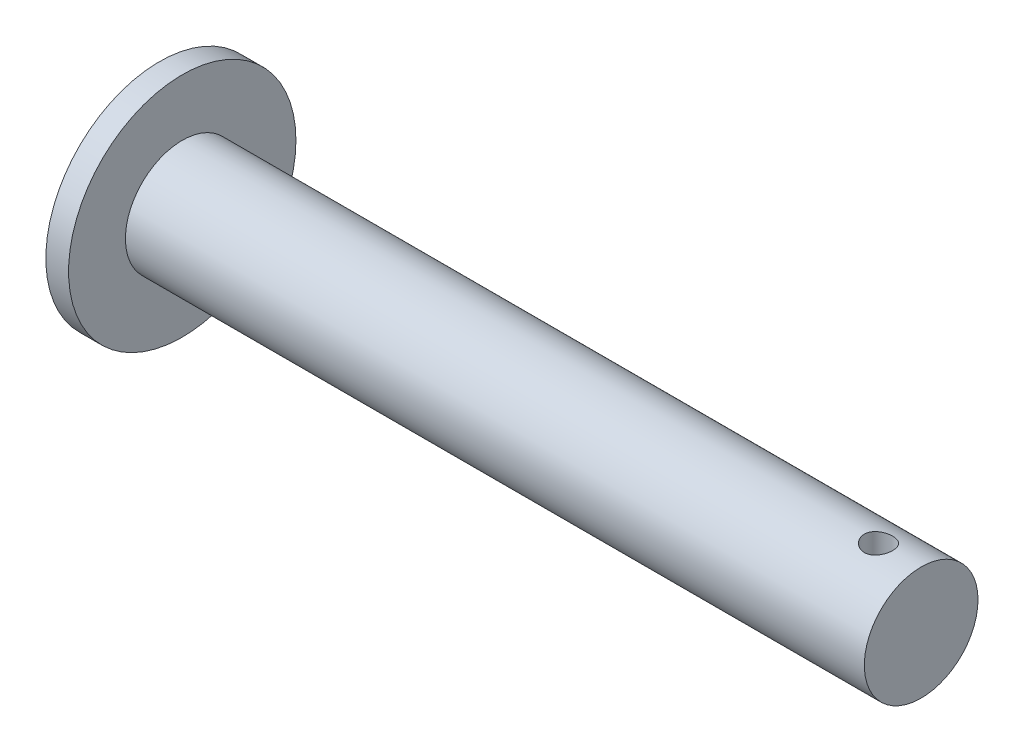
ISO-10303-21;
HEADER;
FILE_DESCRIPTION(('STEP AP214'),'2;1');
FILE_NAME('part.step','',(''),(''),'','','');
FILE_SCHEMA(('AUTOMOTIVE_DESIGN { 1 0 10303 214 1 1 1 1 }'));
ENDSEC;
DATA;
#1=APPLICATION_CONTEXT('core data for automotive mechanical design processes');
#2=APPLICATION_PROTOCOL_DEFINITION('international standard','automotive_design',2000,#1);
#3=PRODUCT_CONTEXT('',#1,'mechanical');
#4=PRODUCT('Part','Part','',(#3));
#5=PRODUCT_RELATED_PRODUCT_CATEGORY('part','',(#4));
#6=PRODUCT_DEFINITION_FORMATION('','',#4);
#7=PRODUCT_DEFINITION_CONTEXT('part definition',#1,'design');
#8=PRODUCT_DEFINITION('design','',#6,#7);
#9=PRODUCT_DEFINITION_SHAPE('','',#8);
#10=(LENGTH_UNIT() NAMED_UNIT(*) SI_UNIT(.MILLI.,.METRE.));
#11=(NAMED_UNIT(*) PLANE_ANGLE_UNIT() SI_UNIT($,.RADIAN.));
#12=(NAMED_UNIT(*) SI_UNIT($,.STERADIAN.) SOLID_ANGLE_UNIT());
#13=UNCERTAINTY_MEASURE_WITH_UNIT(LENGTH_MEASURE(1.E-05),#10,'distance_accuracy_value','');
#14=(GEOMETRIC_REPRESENTATION_CONTEXT(3) GLOBAL_UNCERTAINTY_ASSIGNED_CONTEXT((#13)) GLOBAL_UNIT_ASSIGNED_CONTEXT((#10,
#11,#12)) REPRESENTATION_CONTEXT('',''));
#15=CARTESIAN_POINT('',(0.,0.,0.));
#16=DIRECTION('',(0.,0.,1.));
#17=DIRECTION('',(1.,0.,0.));
#18=AXIS2_PLACEMENT_3D('',#15,#16,#17);
#19=CARTESIAN_POINT('',(2.54,0.,0.));
#20=DIRECTION('',(-1.,0.,0.));
#21=DIRECTION('',(0.,0.,1.));
#22=AXIS2_PLACEMENT_3D('',#19,#20,#21);
#23=CYLINDRICAL_SURFACE('',#22,12.7);
#24=CARTESIAN_POINT('',(2.54,0.,0.));
#25=DIRECTION('',(1.,0.,0.));
#26=DIRECTION('',(0.,0.,-1.));
#27=AXIS2_PLACEMENT_3D('',#24,#25,#26);
#28=CIRCLE('',#27,12.7);
#29=CARTESIAN_POINT('',(2.54,0.,-12.7));
#30=VERTEX_POINT('',#29);
#31=EDGE_CURVE('E43',#30,#30,#28,.T.);
#32=ORIENTED_EDGE('',*,*,#31,.F.);
#33=EDGE_LOOP('',(#32));
#34=FACE_BOUND('',#33,.T.);
#35=CARTESIAN_POINT('',(0.,0.,0.));
#36=DIRECTION('',(1.,0.,0.));
#37=DIRECTION('',(0.,0.,-1.));
#38=AXIS2_PLACEMENT_3D('',#35,#36,#37);
#39=CIRCLE('',#38,12.7);
#40=CARTESIAN_POINT('',(0.,0.,-12.7));
#41=VERTEX_POINT('',#40);
#42=EDGE_CURVE('E48',#41,#41,#39,.T.);
#43=ORIENTED_EDGE('',*,*,#42,.T.);
#44=EDGE_LOOP('',(#43));
#45=FACE_BOUND('',#44,.T.);
#46=ADVANCED_FACE('F31',(#34,#45),#23,.T.);
#47=CARTESIAN_POINT('',(2.54,0.,0.));
#48=DIRECTION('',(1.,0.,0.));
#49=DIRECTION('',(0.,0.,-1.));
#50=AXIS2_PLACEMENT_3D('',#47,#48,#49);
#51=PLANE('',#50);
#52=CARTESIAN_POINT('',(2.54,0.,0.));
#53=DIRECTION('',(1.,0.,0.));
#54=DIRECTION('',(0.,0.,-1.));
#55=AXIS2_PLACEMENT_3D('',#52,#53,#54);
#56=CIRCLE('',#55,6.35);
#57=CARTESIAN_POINT('',(2.54,0.,-6.35));
#58=VERTEX_POINT('',#57);
#59=EDGE_CURVE('E10',#58,#58,#56,.T.);
#60=ORIENTED_EDGE('',*,*,#59,.F.);
#61=EDGE_LOOP('',(#60));
#62=FACE_BOUND('',#61,.T.);
#63=ORIENTED_EDGE('',*,*,#31,.T.);
#64=EDGE_LOOP('',(#63));
#65=FACE_BOUND('',#64,.T.);
#66=ADVANCED_FACE('F78',(#62,#65),#51,.T.);
#67=CARTESIAN_POINT('',(0.,0.,0.));
#68=DIRECTION('',(1.,0.,0.));
#69=DIRECTION('',(0.,0.,-1.));
#70=AXIS2_PLACEMENT_3D('',#67,#68,#69);
#71=PLANE('',#70);
#72=ORIENTED_EDGE('',*,*,#42,.F.);
#73=EDGE_LOOP('',(#72));
#74=FACE_BOUND('',#73,.T.);
#75=ADVANCED_FACE('F74',(#74),#71,.F.);
#76=CARTESIAN_POINT('',(85.09,0.,0.));
#77=DIRECTION('',(-1.,0.,0.));
#78=DIRECTION('',(0.,0.,1.));
#79=AXIS2_PLACEMENT_3D('',#76,#77,#78);
#80=CYLINDRICAL_SURFACE('',#79,6.35);
#81=CARTESIAN_POINT('',(80.3275,-6.14836106210428,1.5875));
#82=CARTESIAN_POINT('',(80.4151622268371,-6.14836273554171,1.58749750990578));
#83=CARTESIAN_POINT('',(80.5028520106605,-6.15025634318835,1.58021416589079));
#84=CARTESIAN_POINT('',(80.6757134121405,-6.15760682365713,1.55131968466973));
#85=CARTESIAN_POINT('',(80.7608835340874,-6.16306577024852,1.52970020878129));
#86=CARTESIAN_POINT('',(80.9261802467488,-6.17689090118439,1.47287691176628));
#87=CARTESIAN_POINT('',(81.0063131936699,-6.1852533310841,1.43769062718758));
#88=CARTESIAN_POINT('',(81.1595473913629,-6.20393851938293,1.35478592470099));
#89=CARTESIAN_POINT('',(81.2326483434209,-6.21426136100349,1.30706697473603));
#90=CARTESIAN_POINT('',(81.3713521447415,-6.23595854885813,1.19932985134303));
#91=CARTESIAN_POINT('',(81.4367774362223,-6.24734969490624,1.13908642369207));
#92=CARTESIAN_POINT('',(81.5567084854188,-6.26975425952214,1.00849561070392));
#93=CARTESIAN_POINT('',(81.6112132222698,-6.28076764269657,0.938147281804498));
#94=CARTESIAN_POINT('',(81.7084824219458,-6.30136163855569,0.78812720268514));
#95=CARTESIAN_POINT('',(81.7510724564825,-6.31092011499376,0.708339055883903));
#96=CARTESIAN_POINT('',(81.8221691240372,-6.32733565573,0.542457122025901));
#97=CARTESIAN_POINT('',(81.8506778349663,-6.33419311857309,0.456364267477876));
#98=CARTESIAN_POINT('',(81.8922338749574,-6.34431521868594,0.282167811808885));
#99=CARTESIAN_POINT('',(81.9055827241474,-6.34764982591139,0.194140276913593));
#100=CARTESIAN_POINT('',(81.91738657084,-6.35059432258134,0.0170363002318534));
#101=CARTESIAN_POINT('',(81.9158437703531,-6.35020476271407,-0.0720399845316785));
#102=CARTESIAN_POINT('',(81.8981249700911,-6.34579690295494,-0.24662169238617));
#103=CARTESIAN_POINT('',(81.8822744335908,-6.34185931486455,-0.332162492266699));
#104=CARTESIAN_POINT('',(81.8369132435192,-6.33089181193282,-0.499329467769232));
#105=CARTESIAN_POINT('',(81.8074018627853,-6.3238617324801,-0.580955434750574));
#106=CARTESIAN_POINT('',(81.7352933676137,-6.30737568660069,-0.738833141809122));
#107=CARTESIAN_POINT('',(81.6925804266398,-6.29789837506359,-0.81502965925433));
#108=CARTESIAN_POINT('',(81.5953691437612,-6.27754588919127,-0.959287550465532));
#109=CARTESIAN_POINT('',(81.540868751464,-6.26667047179331,-1.02734750569825));
#110=CARTESIAN_POINT('',(81.4198849488412,-6.24435958243645,-1.15534128069737));
#111=CARTESIAN_POINT('',(81.3531171433591,-6.23291691898958,-1.21500531553188));
#112=CARTESIAN_POINT('',(81.2104040168019,-6.21103052633108,-1.3223499968413));
#113=CARTESIAN_POINT('',(81.1344582670232,-6.20058684382291,-1.37003008322306));
#114=CARTESIAN_POINT('',(80.9750158283154,-6.18185515488096,-1.45222615482338));
#115=CARTESIAN_POINT('',(80.8914843112511,-6.17357784665832,-1.48667718756566));
#116=CARTESIAN_POINT('',(80.7195582277714,-6.16025336488873,-1.54096342276019));
#117=CARTESIAN_POINT('',(80.6311647063707,-6.15520550014489,-1.56080175290275));
#118=CARTESIAN_POINT('',(80.4545257165328,-6.14905651084854,-1.58485182055239));
#119=CARTESIAN_POINT('',(80.3663380012357,-6.14785466574466,-1.58946245093896));
#120=CARTESIAN_POINT('',(80.1904530702729,-6.1492596311046,-1.58401828897737));
#121=CARTESIAN_POINT('',(80.1027558102009,-6.15186609096804,-1.57396484663399));
#122=CARTESIAN_POINT('',(79.9318224417538,-6.16049747041146,-1.53982766960041));
#123=CARTESIAN_POINT('',(79.8485368186275,-6.16646576098828,-1.51597618335891));
#124=CARTESIAN_POINT('',(79.6871460242642,-6.18109456102061,-1.45517748186084));
#125=CARTESIAN_POINT('',(79.6090414679999,-6.18975538937869,-1.41822871529746));
#126=CARTESIAN_POINT('',(79.4585397885542,-6.20900547054222,-1.33144937413971));
#127=CARTESIAN_POINT('',(79.3862846865726,-6.21962922065218,-1.28138031368562));
#128=CARTESIAN_POINT('',(79.2510553896211,-6.2415234775054,-1.17008321503344));
#129=CARTESIAN_POINT('',(79.1880827229272,-6.25279409032579,-1.10885334300363));
#130=CARTESIAN_POINT('',(79.0715899879674,-6.2750535092507,-0.975142069563244));
#131=CARTESIAN_POINT('',(79.0183458602815,-6.28602820809266,-0.902417474643896));
#132=CARTESIAN_POINT('',(78.924825724486,-6.30616732549721,-0.748828008777791));
#133=CARTESIAN_POINT('',(78.8845490399538,-6.31533183847515,-0.66796356272017));
#134=CARTESIAN_POINT('',(78.8184567680748,-6.33076023493829,-0.500948645248101));
#135=CARTESIAN_POINT('',(78.7925371794193,-6.3370449206423,-0.414841342381758));
#136=CARTESIAN_POINT('',(78.7555826875236,-6.34609661306326,-0.239315244506103));
#137=CARTESIAN_POINT('',(78.7445449117007,-6.34886429864815,-0.149897092002969));
#138=CARTESIAN_POINT('',(78.7378289515488,-6.35054243936488,0.0271200982287863));
#139=CARTESIAN_POINT('',(78.7417435368111,-6.34955516472013,0.114702950308583));
#140=CARTESIAN_POINT('',(78.7638884258297,-6.3440611062616,0.287920900558404));
#141=CARTESIAN_POINT('',(78.7821183038333,-6.33955442711888,0.373556056577162));
#142=CARTESIAN_POINT('',(78.8321578988863,-6.32754374655666,0.54002151908615));
#143=CARTESIAN_POINT('',(78.863893982137,-6.32005601147982,0.620875210147371));
#144=CARTESIAN_POINT('',(78.9399782941932,-6.30287171149997,0.776155821703334));
#145=CARTESIAN_POINT('',(78.9843281128629,-6.29317486818656,0.850581930508272));
#146=CARTESIAN_POINT('',(79.0856229339704,-6.27232758869116,0.992825561372944));
#147=CARTESIAN_POINT('',(79.1428442268655,-6.26114789401158,1.06044204392718));
#148=CARTESIAN_POINT('',(79.2677212775084,-6.23872655372021,1.18525134468062));
#149=CARTESIAN_POINT('',(79.3353796768054,-6.22748489312182,1.24244151604576));
#150=CARTESIAN_POINT('',(79.4807297450446,-6.2059736792862,1.34582221703578));
#151=CARTESIAN_POINT('',(79.5585850459176,-6.19572617421192,1.3917876333714));
#152=CARTESIAN_POINT('',(79.7211630902523,-6.17766029436602,1.46990894837737));
#153=CARTESIAN_POINT('',(79.8058807836944,-6.16984015341641,1.50207489424355));
#154=CARTESIAN_POINT('',(79.9632910062749,-6.15873655124406,1.54689576409763));
#155=CARTESIAN_POINT('',(80.0352303984594,-6.15487502513368,1.56208915832016));
#156=CARTESIAN_POINT('',(80.1806068295374,-6.14968668754596,1.58239188946006));
#157=CARTESIAN_POINT('',(80.254043740139,-6.14835965985316,1.58750208656584));
#158=CARTESIAN_POINT('',(80.3275,-6.14836106210428,1.5875));
#159=B_SPLINE_CURVE_WITH_KNOTS('',3,(#81,#82,#83,#84,#85,#86,#87,#88,#89,#90,#91,#92,#93,#94,
#95,#96,#97,#98,#99,#100,#101,#102,#103,#104,#105,#106,#107,#108,#109,#110,#111,#112,#113,#114,
#115,#116,#117,#118,#119,#120,#121,#122,#123,#124,#125,#126,#127,#128,#129,#130,#131,#132,#133,
#134,#135,#136,#137,#138,#139,#140,#141,#142,#143,#144,#145,#146,#147,#148,#149,#150,#151,#152,
#153,#154,#155,#156,#157,#158),.UNSPECIFIED.,.T.,.F.,(4,2,2,2,2,2,2,2,2,2,2,2,2,2,2,2,2,2,2,2,2,
2,2,2,2,2,2,2,2,2,2,2,2,2,2,2,2,2,4),(0.,0.262716925502453,0.525586795807206,0.788118011750435,
1.0506603748973,1.31841210912539,1.58618886139715,1.85770200212679,2.12917506502904,
2.39514856882045,2.66108274402923,2.92111596807482,3.1811630352024,3.44355975151572,
3.70600214772761,3.97554746273165,4.24510537311875,4.51597034325336,4.78677732082263,
5.05043169973692,5.31406180761715,5.57337852180846,5.832725961026,6.09716107120565,
6.36163966992004,6.63273585162978,6.90381788981916,7.172909662324,7.4419494855724,
7.70371488290935,7.96547249534383,8.22582096615416,8.48620226643676,8.75282156329615,
9.01950845044099,9.29117063075771,9.56263468067803,9.78279620257604,10.002938941882),.UNSPECIFIED.);
#160=CARTESIAN_POINT('',(80.3275,-6.14836106210428,1.5875));
#161=VERTEX_POINT('',#160);
#162=EDGE_CURVE('E34',#161,#161,#159,.T.);
#163=ORIENTED_EDGE('',*,*,#162,.T.);
#164=EDGE_LOOP('',(#163));
#165=FACE_BOUND('',#164,.T.);
#166=CARTESIAN_POINT('',(80.3275,6.14836106210428,1.5875));
#167=CARTESIAN_POINT('',(80.2398377731629,6.14836273554171,1.58749750990578));
#168=CARTESIAN_POINT('',(80.1521479893395,6.15025634318835,1.58021416589079));
#169=CARTESIAN_POINT('',(79.9792865878595,6.15760682365713,1.55131968466973));
#170=CARTESIAN_POINT('',(79.8941164659126,6.16306577024852,1.52970020878129));
#171=CARTESIAN_POINT('',(79.7288197532512,6.17689090118439,1.47287691176628));
#172=CARTESIAN_POINT('',(79.6486868063301,6.1852533310841,1.43769062718758));
#173=CARTESIAN_POINT('',(79.4954526086371,6.20393851938293,1.35478592470099));
#174=CARTESIAN_POINT('',(79.422351656579,6.21426136100349,1.30706697473603));
#175=CARTESIAN_POINT('',(79.2836478552585,6.23595854885813,1.19932985134303));
#176=CARTESIAN_POINT('',(79.2182225637777,6.24734969490624,1.13908642369207));
#177=CARTESIAN_POINT('',(79.0982915145812,6.26975425952214,1.00849561070392));
#178=CARTESIAN_POINT('',(79.0437867777302,6.28076764269657,0.938147281804498));
#179=CARTESIAN_POINT('',(78.9465175780541,6.30136163855569,0.78812720268514));
#180=CARTESIAN_POINT('',(78.9039275435175,6.31092011499376,0.708339055883903));
#181=CARTESIAN_POINT('',(78.8328308759628,6.32733565573,0.542457122025901));
#182=CARTESIAN_POINT('',(78.8043221650337,6.33419311857309,0.456364267477876));
#183=CARTESIAN_POINT('',(78.7627661250426,6.34431521868594,0.282167811808885));
#184=CARTESIAN_POINT('',(78.7494172758526,6.34764982591139,0.194140276913593));
#185=CARTESIAN_POINT('',(78.73761342916,6.35059432258134,0.0170363002318534));
#186=CARTESIAN_POINT('',(78.7391562296469,6.35020476271407,-0.0720399845316785));
#187=CARTESIAN_POINT('',(78.7568750299088,6.34579690295494,-0.24662169238617));
#188=CARTESIAN_POINT('',(78.7727255664092,6.34185931486455,-0.332162492266699));
#189=CARTESIAN_POINT('',(78.8180867564808,6.33089181193282,-0.499329467769232));
#190=CARTESIAN_POINT('',(78.8475981372147,6.3238617324801,-0.580955434750574));
#191=CARTESIAN_POINT('',(78.9197066323863,6.30737568660069,-0.738833141809122));
#192=CARTESIAN_POINT('',(78.9624195733602,6.29789837506359,-0.815029659254331));
#193=CARTESIAN_POINT('',(79.0596308562388,6.27754588919127,-0.959287550465531));
#194=CARTESIAN_POINT('',(79.114131248536,6.26667047179331,-1.02734750569825));
#195=CARTESIAN_POINT('',(79.2351150511588,6.24435958243645,-1.15534128069737));
#196=CARTESIAN_POINT('',(79.3018828566408,6.23291691898958,-1.21500531553188));
#197=CARTESIAN_POINT('',(79.4445959831981,6.21103052633108,-1.32234999684129));
#198=CARTESIAN_POINT('',(79.5205417329768,6.20058684382291,-1.37003008322305));
#199=CARTESIAN_POINT('',(79.6799841716846,6.18185515488096,-1.45222615482338));
#200=CARTESIAN_POINT('',(79.7635156887489,6.17357784665832,-1.48667718756566));
#201=CARTESIAN_POINT('',(79.9354417722286,6.16025336488873,-1.54096342276019));
#202=CARTESIAN_POINT('',(80.0238352936293,6.15520550014489,-1.56080175290275));
#203=CARTESIAN_POINT('',(80.2004742834672,6.14905651084854,-1.58485182055239));
#204=CARTESIAN_POINT('',(80.2886619987643,6.14785466574466,-1.58946245093896));
#205=CARTESIAN_POINT('',(80.4645469297271,6.1492596311046,-1.58401828897737));
#206=CARTESIAN_POINT('',(80.552244189799,6.15186609096804,-1.57396484663399));
#207=CARTESIAN_POINT('',(80.7231775582462,6.16049747041146,-1.53982766960041));
#208=CARTESIAN_POINT('',(80.8064631813725,6.16646576098828,-1.51597618335891));
#209=CARTESIAN_POINT('',(80.9678539757358,6.18109456102061,-1.45517748186084));
#210=CARTESIAN_POINT('',(81.0459585320001,6.1897553893787,-1.41822871529746));
#211=CARTESIAN_POINT('',(81.1964602114458,6.20900547054222,-1.33144937413971));
#212=CARTESIAN_POINT('',(81.2687153134274,6.21962922065218,-1.28138031368562));
#213=CARTESIAN_POINT('',(81.4039446103789,6.2415234775054,-1.17008321503344));
#214=CARTESIAN_POINT('',(81.4669172770728,6.25279409032579,-1.10885334300363));
#215=CARTESIAN_POINT('',(81.5834100120326,6.2750535092507,-0.975142069563244));
#216=CARTESIAN_POINT('',(81.6366541397185,6.28602820809266,-0.902417474643896));
#217=CARTESIAN_POINT('',(81.730174275514,6.30616732549721,-0.748828008777791));
#218=CARTESIAN_POINT('',(81.7704509600462,6.31533183847515,-0.66796356272017));
#219=CARTESIAN_POINT('',(81.8365432319252,6.33076023493829,-0.500948645248101));
#220=CARTESIAN_POINT('',(81.8624628205807,6.3370449206423,-0.414841342381758));
#221=CARTESIAN_POINT('',(81.8994173124764,6.34609661306326,-0.239315244506103));
#222=CARTESIAN_POINT('',(81.9104550882993,6.34886429864815,-0.149897092002969));
#223=CARTESIAN_POINT('',(81.9171710484512,6.35054243936488,0.0271200982287863));
#224=CARTESIAN_POINT('',(81.9132564631889,6.34955516472013,0.114702950308583));
#225=CARTESIAN_POINT('',(81.8911115741702,6.3440611062616,0.287920900558404));
#226=CARTESIAN_POINT('',(81.8728816961667,6.33955442711888,0.373556056577162));
#227=CARTESIAN_POINT('',(81.8228421011137,6.32754374655666,0.54002151908615));
#228=CARTESIAN_POINT('',(81.791106017863,6.32005601147982,0.620875210147371));
#229=CARTESIAN_POINT('',(81.7150217058068,6.30287171149997,0.776155821703334));
#230=CARTESIAN_POINT('',(81.6706718871371,6.29317486818656,0.850581930508273));
#231=CARTESIAN_POINT('',(81.5693770660296,6.27232758869116,0.992825561372947));
#232=CARTESIAN_POINT('',(81.5121557731345,6.26114789401158,1.06044204392719));
#233=CARTESIAN_POINT('',(81.3872787224916,6.23872655372021,1.18525134468063));
#234=CARTESIAN_POINT('',(81.3196203231946,6.22748489312182,1.24244151604576));
#235=CARTESIAN_POINT('',(81.1742702549554,6.2059736792862,1.34582221703578));
#236=CARTESIAN_POINT('',(81.0964149540824,6.19572617421192,1.3917876333714));
#237=CARTESIAN_POINT('',(80.9338369097477,6.17766029436602,1.46990894837737));
#238=CARTESIAN_POINT('',(80.8491192163055,6.16984015341641,1.50207489424355));
#239=CARTESIAN_POINT('',(80.6917089937251,6.15873655124406,1.54689576409763));
#240=CARTESIAN_POINT('',(80.6197696015406,6.15487502513368,1.56208915832016));
#241=CARTESIAN_POINT('',(80.4743931704625,6.14968668754596,1.58239188946006));
#242=CARTESIAN_POINT('',(80.400956259861,6.14835965985316,1.58750208656584));
#243=CARTESIAN_POINT('',(80.3275,6.14836106210428,1.5875));
#244=B_SPLINE_CURVE_WITH_KNOTS('',3,(#166,#167,#168,#169,#170,#171,#172,#173,#174,#175,#176,
#177,#178,#179,#180,#181,#182,#183,#184,#185,#186,#187,#188,#189,#190,#191,#192,#193,#194,#195,
#196,#197,#198,#199,#200,#201,#202,#203,#204,#205,#206,#207,#208,#209,#210,#211,#212,#213,#214,
#215,#216,#217,#218,#219,#220,#221,#222,#223,#224,#225,#226,#227,#228,#229,#230,#231,#232,#233,
#234,#235,#236,#237,#238,#239,#240,#241,#242,#243),.UNSPECIFIED.,.T.,.F.,(4,2,2,2,2,2,2,2,2,2,2,
2,2,2,2,2,2,2,2,2,2,2,2,2,2,2,2,2,2,2,2,2,2,2,2,2,2,2,4),(0.,0.262716925502453,
0.525586795807206,0.788118011750435,1.0506603748973,1.31841210912539,1.58618886139715,
1.85770200212679,2.12917506502904,2.39514856882045,2.66108274402923,2.92111596807482,
3.1811630352024,3.44355975151572,3.70600214772761,3.97554746273163,4.24510537311876,
4.51597034325337,4.78677732082263,5.05043169973692,5.31406180761715,5.57337852180847,
5.832725961026,6.09716107120566,6.36163966992005,6.63273585162978,6.90381788981917,
7.172909662324,7.4419494855724,7.70371488290935,7.96547249534383,8.22582096615416,
8.48620226643676,8.75282156329617,9.01950845044099,9.29117063075771,9.56263468067803,
9.78279620257604,10.002938941882),.UNSPECIFIED.);
#245=CARTESIAN_POINT('',(80.3275,6.14836106210428,1.5875));
#246=VERTEX_POINT('',#245);
#247=EDGE_CURVE('E54',#246,#246,#244,.T.);
#248=ORIENTED_EDGE('',*,*,#247,.T.);
#249=EDGE_LOOP('',(#248));
#250=FACE_BOUND('',#249,.T.);
#251=CARTESIAN_POINT('',(85.09,0.,0.));
#252=DIRECTION('',(1.,0.,0.));
#253=DIRECTION('',(0.,0.,-1.));
#254=AXIS2_PLACEMENT_3D('',#251,#252,#253);
#255=CIRCLE('',#254,6.35);
#256=CARTESIAN_POINT('',(85.09,0.,-6.35));
#257=VERTEX_POINT('',#256);
#258=EDGE_CURVE('E51',#257,#257,#255,.T.);
#259=ORIENTED_EDGE('',*,*,#258,.F.);
#260=EDGE_LOOP('',(#259));
#261=FACE_BOUND('',#260,.T.);
#262=ORIENTED_EDGE('',*,*,#59,.T.);
#263=EDGE_LOOP('',(#262));
#264=FACE_BOUND('',#263,.T.);
#265=ADVANCED_FACE('F59',(#165,#250,#261,#264),#80,.T.);
#266=CARTESIAN_POINT('',(85.09,0.,0.));
#267=DIRECTION('',(1.,0.,0.));
#268=DIRECTION('',(0.,0.,-1.));
#269=AXIS2_PLACEMENT_3D('',#266,#267,#268);
#270=PLANE('',#269);
#271=ORIENTED_EDGE('',*,*,#258,.T.);
#272=EDGE_LOOP('',(#271));
#273=FACE_BOUND('',#272,.T.);
#274=ADVANCED_FACE('F66',(#273),#270,.T.);
#275=CARTESIAN_POINT('',(80.3275,-12.7,0.));
#276=DIRECTION('',(0.,1.,0.));
#277=DIRECTION('',(0.,0.,1.));
#278=AXIS2_PLACEMENT_3D('',#275,#276,#277);
#279=CYLINDRICAL_SURFACE('',#278,1.5875);
#280=ORIENTED_EDGE('',*,*,#247,.F.);
#281=EDGE_LOOP('',(#280));
#282=FACE_BOUND('',#281,.T.);
#283=ORIENTED_EDGE('',*,*,#162,.F.);
#284=EDGE_LOOP('',(#283));
#285=FACE_BOUND('',#284,.T.);
#286=ADVANCED_FACE('F63',(#282,#285),#279,.F.);
#287=CLOSED_SHELL('',(#46,#66,#75,#265,#274,#286));
#288=MANIFOLD_SOLID_BREP('B2',#287);
#289=ADVANCED_BREP_SHAPE_REPRESENTATION('',(#18,#288),#14);
#290=SHAPE_DEFINITION_REPRESENTATION(#9,#289);
ENDSEC;
END-ISO-10303-21;
